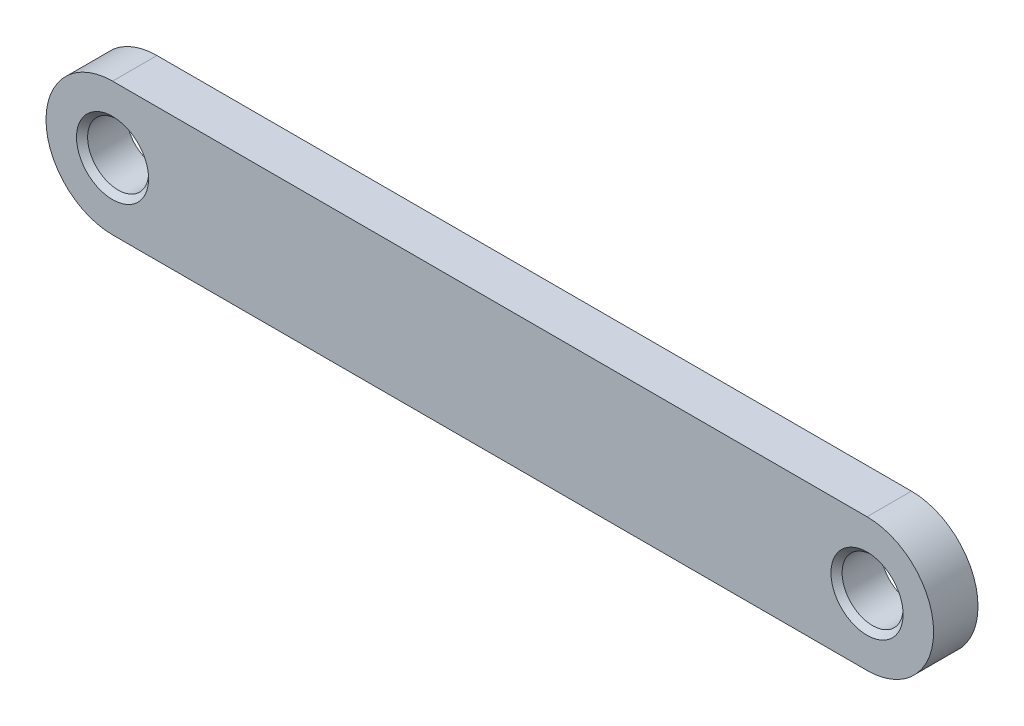
ISO-10303-21;
HEADER;
FILE_DESCRIPTION(('STEP AP214'),'2;1');
FILE_NAME('part.step','',(''),(''),'','','');
FILE_SCHEMA(('AUTOMOTIVE_DESIGN { 1 0 10303 214 1 1 1 1 }'));
ENDSEC;
DATA;
#1=APPLICATION_CONTEXT('core data for automotive mechanical design processes');
#2=APPLICATION_PROTOCOL_DEFINITION('international standard','automotive_design',2000,#1);
#3=PRODUCT_CONTEXT('',#1,'mechanical');
#4=PRODUCT('Part','Part','',(#3));
#5=PRODUCT_RELATED_PRODUCT_CATEGORY('part','',(#4));
#6=PRODUCT_DEFINITION_FORMATION('','',#4);
#7=PRODUCT_DEFINITION_CONTEXT('part definition',#1,'design');
#8=PRODUCT_DEFINITION('design','',#6,#7);
#9=PRODUCT_DEFINITION_SHAPE('','',#8);
#10=(LENGTH_UNIT() NAMED_UNIT(*) SI_UNIT(.MILLI.,.METRE.));
#11=(NAMED_UNIT(*) PLANE_ANGLE_UNIT() SI_UNIT($,.RADIAN.));
#12=(NAMED_UNIT(*) SI_UNIT($,.STERADIAN.) SOLID_ANGLE_UNIT());
#13=UNCERTAINTY_MEASURE_WITH_UNIT(LENGTH_MEASURE(1.E-05),#10,'distance_accuracy_value','');
#14=(GEOMETRIC_REPRESENTATION_CONTEXT(3) GLOBAL_UNCERTAINTY_ASSIGNED_CONTEXT((#13)) GLOBAL_UNIT_ASSIGNED_CONTEXT((#10,
#11,#12)) REPRESENTATION_CONTEXT('',''));
#15=CARTESIAN_POINT('',(0.,0.,0.));
#16=DIRECTION('',(0.,0.,1.));
#17=DIRECTION('',(1.,0.,0.));
#18=AXIS2_PLACEMENT_3D('',#15,#16,#17);
#19=CARTESIAN_POINT('',(44.5,-50.65,2.));
#20=DIRECTION('',(0.,0.,-1.));
#21=DIRECTION('',(-1.,0.,0.));
#22=AXIS2_PLACEMENT_3D('',#19,#20,#21);
#23=PLANE('',#22);
#24=CARTESIAN_POINT('',(44.5,-50.65,2.));
#25=DIRECTION('',(0.,0.,-1.));
#26=DIRECTION('',(-1.,0.,0.));
#27=AXIS2_PLACEMENT_3D('',#24,#25,#26);
#28=CIRCLE('',#27,1.62500000000001);
#29=CARTESIAN_POINT('',(42.875,-50.65,2.));
#30=VERTEX_POINT('',#29);
#31=EDGE_CURVE('E46',#30,#30,#28,.T.);
#32=ORIENTED_EDGE('',*,*,#31,.T.);
#33=EDGE_LOOP('',(#32));
#34=FACE_BOUND('',#33,.T.);
#35=CARTESIAN_POINT('',(10.5,-50.65,2.));
#36=DIRECTION('',(0.,0.,-1.));
#37=DIRECTION('',(-1.,0.,0.));
#38=AXIS2_PLACEMENT_3D('',#35,#36,#37);
#39=CIRCLE('',#38,1.62500000000001);
#40=CARTESIAN_POINT('',(8.87499999999999,-50.65,2.));
#41=VERTEX_POINT('',#40);
#42=EDGE_CURVE('E117',#41,#41,#39,.T.);
#43=ORIENTED_EDGE('',*,*,#42,.T.);
#44=EDGE_LOOP('',(#43));
#45=FACE_BOUND('',#44,.T.);
#46=CARTESIAN_POINT('',(44.5,-50.65,2.));
#47=DIRECTION('',(0.,0.,1.));
#48=DIRECTION('',(-1.,0.,0.));
#49=AXIS2_PLACEMENT_3D('',#46,#47,#48);
#50=CIRCLE('',#49,3.);
#51=CARTESIAN_POINT('',(44.5,-53.65,2.));
#52=VERTEX_POINT('',#51);
#53=CARTESIAN_POINT('',(44.5,-47.65,2.));
#54=VERTEX_POINT('',#53);
#55=EDGE_CURVE('E89',#52,#54,#50,.T.);
#56=ORIENTED_EDGE('',*,*,#55,.T.);
#57=DIRECTION('',(-1.,0.,0.));
#58=VECTOR('',#57,1.);
#59=CARTESIAN_POINT('',(44.5,-47.65,2.));
#60=LINE('',#59,#58);
#61=CARTESIAN_POINT('',(10.5,-47.65,2.));
#62=VERTEX_POINT('',#61);
#63=EDGE_CURVE('E85',#54,#62,#60,.T.);
#64=ORIENTED_EDGE('',*,*,#63,.T.);
#65=CARTESIAN_POINT('',(10.5,-50.65,2.));
#66=DIRECTION('',(0.,0.,1.));
#67=DIRECTION('',(1.,0.,0.));
#68=AXIS2_PLACEMENT_3D('',#65,#66,#67);
#69=CIRCLE('',#68,3.);
#70=CARTESIAN_POINT('',(10.5,-53.65,2.));
#71=VERTEX_POINT('',#70);
#72=EDGE_CURVE('E87',#62,#71,#69,.T.);
#73=ORIENTED_EDGE('',*,*,#72,.T.);
#74=DIRECTION('',(1.,0.,0.));
#75=VECTOR('',#74,1.);
#76=CARTESIAN_POINT('',(44.5,-53.65,2.));
#77=LINE('',#76,#75);
#78=EDGE_CURVE('E54',#71,#52,#77,.T.);
#79=ORIENTED_EDGE('',*,*,#78,.T.);
#80=EDGE_LOOP('',(#56,#64,#73,#79));
#81=FACE_BOUND('',#80,.T.);
#82=ADVANCED_FACE('F36',(#34,#45,#81),#23,.F.);
#83=CARTESIAN_POINT('',(44.5,-50.65,0.));
#84=DIRECTION('',(0.,0.,-1.));
#85=DIRECTION('',(-1.,0.,0.));
#86=AXIS2_PLACEMENT_3D('',#83,#84,#85);
#87=PLANE('',#86);
#88=CARTESIAN_POINT('',(10.5,-50.65,0.));
#89=DIRECTION('',(0.,0.,1.));
#90=DIRECTION('',(1.,0.,0.));
#91=AXIS2_PLACEMENT_3D('',#88,#89,#90);
#92=CIRCLE('',#91,1.375);
#93=CARTESIAN_POINT('',(11.875,-50.65,0.));
#94=VERTEX_POINT('',#93);
#95=EDGE_CURVE('E107',#94,#94,#92,.T.);
#96=ORIENTED_EDGE('',*,*,#95,.T.);
#97=EDGE_LOOP('',(#96));
#98=FACE_BOUND('',#97,.T.);
#99=CARTESIAN_POINT('',(44.5,-50.65,0.));
#100=DIRECTION('',(0.,0.,1.));
#101=DIRECTION('',(-1.,0.,0.));
#102=AXIS2_PLACEMENT_3D('',#99,#100,#101);
#103=CIRCLE('',#102,3.);
#104=CARTESIAN_POINT('',(44.5,-53.65,0.));
#105=VERTEX_POINT('',#104);
#106=CARTESIAN_POINT('',(44.5,-47.65,0.));
#107=VERTEX_POINT('',#106);
#108=EDGE_CURVE('E104',#105,#107,#103,.T.);
#109=ORIENTED_EDGE('',*,*,#108,.F.);
#110=DIRECTION('',(1.,0.,0.));
#111=VECTOR('',#110,1.);
#112=CARTESIAN_POINT('',(44.5,-53.65,0.));
#113=LINE('',#112,#111);
#114=CARTESIAN_POINT('',(10.5,-53.65,0.));
#115=VERTEX_POINT('',#114);
#116=EDGE_CURVE('E77',#115,#105,#113,.T.);
#117=ORIENTED_EDGE('',*,*,#116,.F.);
#118=CARTESIAN_POINT('',(10.5,-50.65,0.));
#119=DIRECTION('',(0.,0.,1.));
#120=DIRECTION('',(1.,0.,0.));
#121=AXIS2_PLACEMENT_3D('',#118,#119,#120);
#122=CIRCLE('',#121,3.);
#123=CARTESIAN_POINT('',(10.5,-47.65,0.));
#124=VERTEX_POINT('',#123);
#125=EDGE_CURVE('E71',#124,#115,#122,.T.);
#126=ORIENTED_EDGE('',*,*,#125,.F.);
#127=DIRECTION('',(-1.,0.,0.));
#128=VECTOR('',#127,1.);
#129=CARTESIAN_POINT('',(44.5,-47.65,0.));
#130=LINE('',#129,#128);
#131=EDGE_CURVE('E94',#107,#124,#130,.T.);
#132=ORIENTED_EDGE('',*,*,#131,.F.);
#133=EDGE_LOOP('',(#109,#117,#126,#132));
#134=FACE_BOUND('',#133,.T.);
#135=CARTESIAN_POINT('',(44.5,-50.65,0.));
#136=DIRECTION('',(0.,0.,1.));
#137=DIRECTION('',(1.,0.,0.));
#138=AXIS2_PLACEMENT_3D('',#135,#136,#137);
#139=CIRCLE('',#138,1.375);
#140=CARTESIAN_POINT('',(45.875,-50.65,0.));
#141=VERTEX_POINT('',#140);
#142=EDGE_CURVE('E136',#141,#141,#139,.T.);
#143=ORIENTED_EDGE('',*,*,#142,.T.);
#144=EDGE_LOOP('',(#143));
#145=FACE_BOUND('',#144,.T.);
#146=ADVANCED_FACE('F143',(#98,#134,#145),#87,.T.);
#147=CARTESIAN_POINT('',(44.5,-50.65,2.));
#148=DIRECTION('',(0.,0.,-1.));
#149=DIRECTION('',(-1.,0.,0.));
#150=AXIS2_PLACEMENT_3D('',#147,#148,#149);
#151=CYLINDRICAL_SURFACE('',#150,3.);
#152=ORIENTED_EDGE('',*,*,#108,.T.);
#153=DIRECTION('',(0.,0.,-1.));
#154=VECTOR('',#153,1.);
#155=CARTESIAN_POINT('',(44.5,-47.65,2.));
#156=LINE('',#155,#154);
#157=EDGE_CURVE('E95',#54,#107,#156,.T.);
#158=ORIENTED_EDGE('',*,*,#157,.F.);
#159=ORIENTED_EDGE('',*,*,#55,.F.);
#160=DIRECTION('',(0.,0.,-1.));
#161=VECTOR('',#160,1.);
#162=CARTESIAN_POINT('',(44.5,-53.65,2.));
#163=LINE('',#162,#161);
#164=EDGE_CURVE('E100',#52,#105,#163,.T.);
#165=ORIENTED_EDGE('',*,*,#164,.T.);
#166=EDGE_LOOP('',(#152,#158,#159,#165));
#167=FACE_BOUND('',#166,.T.);
#168=ADVANCED_FACE('F159',(#167),#151,.T.);
#169=CARTESIAN_POINT('',(44.5,-47.65,2.));
#170=DIRECTION('',(0.,-1.,0.));
#171=DIRECTION('',(1.,0.,0.));
#172=AXIS2_PLACEMENT_3D('',#169,#170,#171);
#173=PLANE('',#172);
#174=ORIENTED_EDGE('',*,*,#131,.T.);
#175=DIRECTION('',(0.,0.,-1.));
#176=VECTOR('',#175,1.);
#177=CARTESIAN_POINT('',(10.5,-47.65,2.));
#178=LINE('',#177,#176);
#179=EDGE_CURVE('E92',#62,#124,#178,.T.);
#180=ORIENTED_EDGE('',*,*,#179,.F.);
#181=ORIENTED_EDGE('',*,*,#63,.F.);
#182=ORIENTED_EDGE('',*,*,#157,.T.);
#183=EDGE_LOOP('',(#174,#180,#181,#182));
#184=FACE_BOUND('',#183,.T.);
#185=ADVANCED_FACE('F93',(#184),#173,.F.);
#186=CARTESIAN_POINT('',(10.5,-50.65,2.));
#187=DIRECTION('',(0.,0.,-1.));
#188=DIRECTION('',(-1.,0.,0.));
#189=AXIS2_PLACEMENT_3D('',#186,#187,#188);
#190=CYLINDRICAL_SURFACE('',#189,3.);
#191=ORIENTED_EDGE('',*,*,#125,.T.);
#192=DIRECTION('',(0.,0.,-1.));
#193=VECTOR('',#192,1.);
#194=CARTESIAN_POINT('',(10.5,-53.65,2.));
#195=LINE('',#194,#193);
#196=EDGE_CURVE('E96',#71,#115,#195,.T.);
#197=ORIENTED_EDGE('',*,*,#196,.F.);
#198=ORIENTED_EDGE('',*,*,#72,.F.);
#199=ORIENTED_EDGE('',*,*,#179,.T.);
#200=EDGE_LOOP('',(#191,#197,#198,#199));
#201=FACE_BOUND('',#200,.T.);
#202=ADVANCED_FACE('F98',(#201),#190,.T.);
#203=CARTESIAN_POINT('',(44.5,-53.65,2.));
#204=DIRECTION('',(0.,1.,0.));
#205=DIRECTION('',(-1.,0.,0.));
#206=AXIS2_PLACEMENT_3D('',#203,#204,#205);
#207=PLANE('',#206);
#208=ORIENTED_EDGE('',*,*,#116,.T.);
#209=ORIENTED_EDGE('',*,*,#164,.F.);
#210=ORIENTED_EDGE('',*,*,#78,.F.);
#211=ORIENTED_EDGE('',*,*,#196,.T.);
#212=EDGE_LOOP('',(#208,#209,#210,#211));
#213=FACE_BOUND('',#212,.T.);
#214=ADVANCED_FACE('F147',(#213),#207,.F.);
#215=CARTESIAN_POINT('',(10.5,-50.65,2.));
#216=DIRECTION('',(0.,0.,-1.));
#217=DIRECTION('',(-1.,0.,0.));
#218=AXIS2_PLACEMENT_3D('',#215,#216,#217);
#219=CYLINDRICAL_SURFACE('',#218,1.375);
#220=CARTESIAN_POINT('',(10.5,-50.65,1.75));
#221=DIRECTION('',(0.,0.,-1.));
#222=DIRECTION('',(-1.,0.,0.));
#223=AXIS2_PLACEMENT_3D('',#220,#221,#222);
#224=CIRCLE('',#223,1.375);
#225=CARTESIAN_POINT('',(9.125,-50.65,1.75));
#226=VERTEX_POINT('',#225);
#227=EDGE_CURVE('E11',#226,#226,#224,.F.);
#228=ORIENTED_EDGE('',*,*,#227,.T.);
#229=EDGE_LOOP('',(#228));
#230=FACE_BOUND('',#229,.T.);
#231=ORIENTED_EDGE('',*,*,#95,.F.);
#232=EDGE_LOOP('',(#231));
#233=FACE_BOUND('',#232,.T.);
#234=ADVANCED_FACE('F132',(#230,#233),#219,.F.);
#235=CARTESIAN_POINT('',(44.5,-50.65,2.));
#236=DIRECTION('',(0.,0.,-1.));
#237=DIRECTION('',(-1.,0.,0.));
#238=AXIS2_PLACEMENT_3D('',#235,#236,#237);
#239=CYLINDRICAL_SURFACE('',#238,1.375);
#240=CARTESIAN_POINT('',(44.5,-50.65,1.75));
#241=DIRECTION('',(0.,0.,-1.));
#242=DIRECTION('',(-1.,0.,0.));
#243=AXIS2_PLACEMENT_3D('',#240,#241,#242);
#244=CIRCLE('',#243,1.375);
#245=CARTESIAN_POINT('',(43.125,-50.65,1.75));
#246=VERTEX_POINT('',#245);
#247=EDGE_CURVE('E114',#246,#246,#244,.F.);
#248=ORIENTED_EDGE('',*,*,#247,.T.);
#249=EDGE_LOOP('',(#248));
#250=FACE_BOUND('',#249,.T.);
#251=ORIENTED_EDGE('',*,*,#142,.F.);
#252=EDGE_LOOP('',(#251));
#253=FACE_BOUND('',#252,.T.);
#254=ADVANCED_FACE('F127',(#250,#253),#239,.F.);
#255=CARTESIAN_POINT('',(44.5,-50.65,1.75));
#256=DIRECTION('',(0.,0.,1.));
#257=DIRECTION('',(1.,0.,0.));
#258=AXIS2_PLACEMENT_3D('',#255,#256,#257);
#259=CONICAL_SURFACE('',#258,1.375,0.785398163397452);
#260=ORIENTED_EDGE('',*,*,#31,.F.);
#261=EDGE_LOOP('',(#260));
#262=FACE_BOUND('',#261,.T.);
#263=ORIENTED_EDGE('',*,*,#247,.F.);
#264=EDGE_LOOP('',(#263));
#265=FACE_BOUND('',#264,.T.);
#266=ADVANCED_FACE('F124',(#262,#265),#259,.F.);
#267=CARTESIAN_POINT('',(10.5,-50.65,1.75));
#268=DIRECTION('',(0.,0.,1.));
#269=DIRECTION('',(1.,0.,0.));
#270=AXIS2_PLACEMENT_3D('',#267,#268,#269);
#271=CONICAL_SURFACE('',#270,1.375,0.785398163397459);
#272=ORIENTED_EDGE('',*,*,#42,.F.);
#273=EDGE_LOOP('',(#272));
#274=FACE_BOUND('',#273,.T.);
#275=ORIENTED_EDGE('',*,*,#227,.F.);
#276=EDGE_LOOP('',(#275));
#277=FACE_BOUND('',#276,.T.);
#278=ADVANCED_FACE('F39',(#274,#277),#271,.F.);
#279=CLOSED_SHELL('',(#82,#146,#168,#185,#202,#214,#234,#254,#266,#278));
#280=MANIFOLD_SOLID_BREP('B2',#279);
#281=ADVANCED_BREP_SHAPE_REPRESENTATION('',(#18,#280),#14);
#282=SHAPE_DEFINITION_REPRESENTATION(#9,#281);
ENDSEC;
END-ISO-10303-21;
